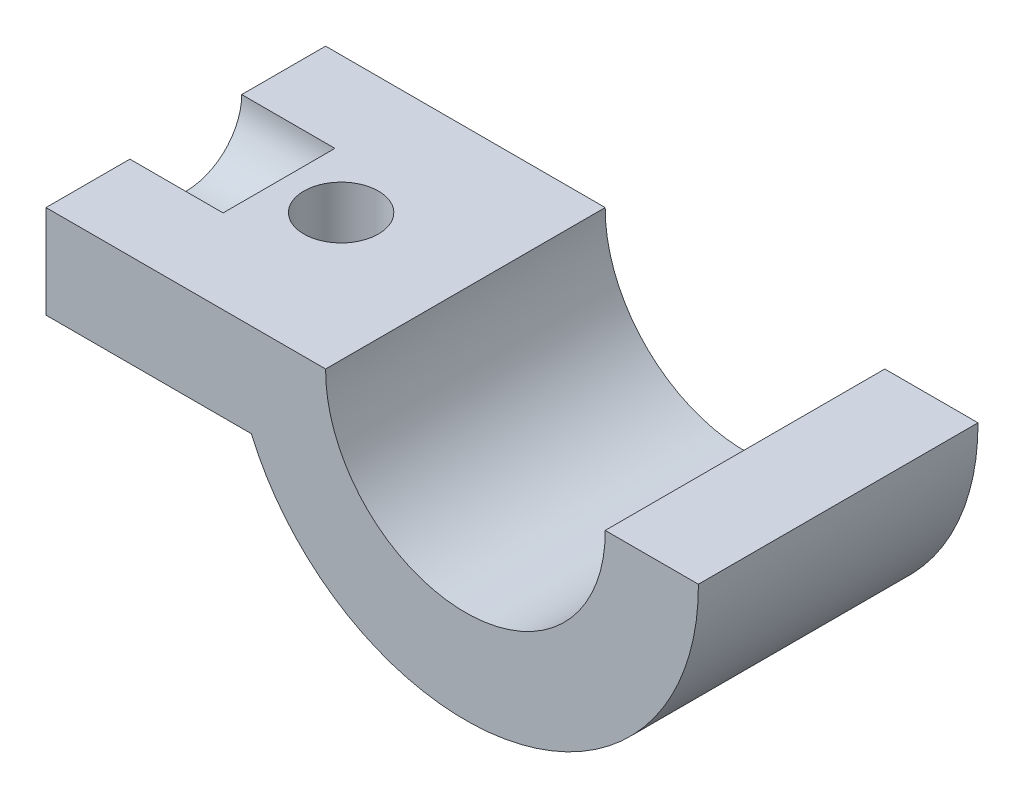
ISO-10303-21;
HEADER;
FILE_DESCRIPTION(('STEP AP214'),'2;1');
FILE_NAME('part.step','',(''),(''),'','','');
FILE_SCHEMA(('AUTOMOTIVE_DESIGN { 1 0 10303 214 1 1 1 1 }'));
ENDSEC;
DATA;
#1=APPLICATION_CONTEXT('core data for automotive mechanical design processes');
#2=APPLICATION_PROTOCOL_DEFINITION('international standard','automotive_design',2000,#1);
#3=PRODUCT_CONTEXT('',#1,'mechanical');
#4=PRODUCT('Part','Part','',(#3));
#5=PRODUCT_RELATED_PRODUCT_CATEGORY('part','',(#4));
#6=PRODUCT_DEFINITION_FORMATION('','',#4);
#7=PRODUCT_DEFINITION_CONTEXT('part definition',#1,'design');
#8=PRODUCT_DEFINITION('design','',#6,#7);
#9=PRODUCT_DEFINITION_SHAPE('','',#8);
#10=(LENGTH_UNIT() NAMED_UNIT(*) SI_UNIT(.MILLI.,.METRE.));
#11=(NAMED_UNIT(*) PLANE_ANGLE_UNIT() SI_UNIT($,.RADIAN.));
#12=(NAMED_UNIT(*) SI_UNIT($,.STERADIAN.) SOLID_ANGLE_UNIT());
#13=UNCERTAINTY_MEASURE_WITH_UNIT(LENGTH_MEASURE(1.E-05),#10,'distance_accuracy_value','');
#14=(GEOMETRIC_REPRESENTATION_CONTEXT(3) GLOBAL_UNCERTAINTY_ASSIGNED_CONTEXT((#13)) GLOBAL_UNIT_ASSIGNED_CONTEXT((#10,
#11,#12)) REPRESENTATION_CONTEXT('',''));
#15=CARTESIAN_POINT('',(0.,0.,0.));
#16=DIRECTION('',(0.,0.,1.));
#17=DIRECTION('',(1.,0.,0.));
#18=AXIS2_PLACEMENT_3D('',#15,#16,#17);
#19=CARTESIAN_POINT('',(9.58502536883147,-0.5,-1.5));
#20=DIRECTION('',(0.,-1.,0.));
#21=DIRECTION('',(1.,0.,0.));
#22=AXIS2_PLACEMENT_3D('',#19,#20,#21);
#23=PLANE('',#22);
#24=CARTESIAN_POINT('',(8.56480931815895,-0.500000000000053,-0.768458184701557));
#25=DIRECTION('',(0.,1.,0.));
#26=DIRECTION('',(-1.,0.,0.));
#27=AXIS2_PLACEMENT_3D('',#24,#25,#26);
#28=CIRCLE('',#27,0.200000000000001);
#29=CARTESIAN_POINT('',(8.36480931815895,-0.500000000000051,-0.768458184701557));
#30=VERTEX_POINT('',#29);
#31=EDGE_CURVE('E185',#30,#30,#28,.T.);
#32=ORIENTED_EDGE('',*,*,#31,.T.);
#33=EDGE_LOOP('',(#32));
#34=FACE_BOUND('',#33,.T.);
#35=DIRECTION('',(1.,0.,0.));
#36=VECTOR('',#35,1.);
#37=CARTESIAN_POINT('',(9.58502536883147,-0.5,0.));
#38=LINE('',#37,#36);
#39=CARTESIAN_POINT('',(7.74999999999999,-0.5,0.));
#40=VERTEX_POINT('',#39);
#41=CARTESIAN_POINT('',(8.85151010795144,-0.5,0.));
#42=VERTEX_POINT('',#41);
#43=EDGE_CURVE('E130',#40,#42,#38,.T.);
#44=ORIENTED_EDGE('',*,*,#43,.F.);
#45=DIRECTION('',(0.,0.,1.));
#46=VECTOR('',#45,1.);
#47=CARTESIAN_POINT('',(7.74999999999999,-0.5,-1.5));
#48=LINE('',#47,#46);
#49=CARTESIAN_POINT('',(7.74999999999999,-0.5,-1.5));
#50=VERTEX_POINT('',#49);
#51=EDGE_CURVE('E143',#50,#40,#48,.T.);
#52=ORIENTED_EDGE('',*,*,#51,.F.);
#53=DIRECTION('',(1.,0.,0.));
#54=VECTOR('',#53,1.);
#55=CARTESIAN_POINT('',(9.58502536883147,-0.5,-1.5));
#56=LINE('',#55,#54);
#57=CARTESIAN_POINT('',(8.85151010795144,-0.5,-1.5));
#58=VERTEX_POINT('',#57);
#59=EDGE_CURVE('E118',#50,#58,#56,.T.);
#60=ORIENTED_EDGE('',*,*,#59,.T.);
#61=DIRECTION('',(0.,0.,1.));
#62=VECTOR('',#61,1.);
#63=CARTESIAN_POINT('',(8.85151010795144,-0.5,-1.5));
#64=LINE('',#63,#62);
#65=EDGE_CURVE('E116',#58,#42,#64,.T.);
#66=ORIENTED_EDGE('',*,*,#65,.T.);
#67=EDGE_LOOP('',(#44,#52,#60,#66));
#68=FACE_BOUND('',#67,.T.);
#69=ADVANCED_FACE('F33',(#34,#68),#23,.T.);
#70=CARTESIAN_POINT('',(7.74999999999999,-3.58172628088967,-1.5));
#71=DIRECTION('',(-1.,0.,0.));
#72=DIRECTION('',(0.,0.,1.));
#73=AXIS2_PLACEMENT_3D('',#70,#71,#72);
#74=PLANE('',#73);
#75=CARTESIAN_POINT('',(7.74999999999999,0.,-0.75));
#76=DIRECTION('',(-1.,0.,0.));
#77=DIRECTION('',(0.,0.,1.));
#78=AXIS2_PLACEMENT_3D('',#75,#76,#77);
#79=CIRCLE('',#78,0.3);
#80=CARTESIAN_POINT('',(7.74999999999999,0.,-1.05));
#81=VERTEX_POINT('',#80);
#82=CARTESIAN_POINT('',(7.74999999999999,0.,-0.45));
#83=VERTEX_POINT('',#82);
#84=EDGE_CURVE('E157',#81,#83,#79,.T.);
#85=ORIENTED_EDGE('',*,*,#84,.F.);
#86=DIRECTION('',(0.,0.,1.));
#87=VECTOR('',#86,1.);
#88=CARTESIAN_POINT('',(7.74999999999999,0.,-1.5));
#89=LINE('',#88,#87);
#90=CARTESIAN_POINT('',(7.74999999999999,0.,-1.5));
#91=VERTEX_POINT('',#90);
#92=EDGE_CURVE('E146',#91,#81,#89,.T.);
#93=ORIENTED_EDGE('',*,*,#92,.F.);
#94=DIRECTION('',(0.,-1.,0.));
#95=VECTOR('',#94,1.);
#96=CARTESIAN_POINT('',(7.74999999999999,-3.58172628088967,-1.5));
#97=LINE('',#96,#95);
#98=EDGE_CURVE('E121',#91,#50,#97,.T.);
#99=ORIENTED_EDGE('',*,*,#98,.T.);
#100=ORIENTED_EDGE('',*,*,#51,.T.);
#101=DIRECTION('',(0.,-1.,0.));
#102=VECTOR('',#101,1.);
#103=CARTESIAN_POINT('',(7.74999999999999,-3.58172628088967,0.));
#104=LINE('',#103,#102);
#105=CARTESIAN_POINT('',(7.74999999999999,0.,0.));
#106=VERTEX_POINT('',#105);
#107=EDGE_CURVE('E138',#106,#40,#104,.T.);
#108=ORIENTED_EDGE('',*,*,#107,.F.);
#109=EDGE_CURVE('E149',#83,#106,#89,.T.);
#110=ORIENTED_EDGE('',*,*,#109,.F.);
#111=EDGE_LOOP('',(#85,#93,#99,#100,#108,#110));
#112=FACE_BOUND('',#111,.T.);
#113=ADVANCED_FACE('F175',(#112),#74,.T.);
#114=CARTESIAN_POINT('',(9.58502536883149,0.,-1.5));
#115=DIRECTION('',(0.,1.,0.));
#116=DIRECTION('',(-1.,0.,0.));
#117=AXIS2_PLACEMENT_3D('',#114,#115,#116);
#118=PLANE('',#117);
#119=CARTESIAN_POINT('',(8.56480931815895,0.,-0.768458184701557));
#120=DIRECTION('',(0.,1.,0.));
#121=DIRECTION('',(-1.,0.,0.));
#122=AXIS2_PLACEMENT_3D('',#119,#120,#121);
#123=CIRCLE('',#122,0.200000000000001);
#124=CARTESIAN_POINT('',(8.36480931815895,0.,-0.768458184701557));
#125=VERTEX_POINT('',#124);
#126=EDGE_CURVE('E193',#125,#125,#123,.T.);
#127=ORIENTED_EDGE('',*,*,#126,.F.);
#128=EDGE_LOOP('',(#127));
#129=FACE_BOUND('',#128,.T.);
#130=DIRECTION('',(0.,0.,1.));
#131=VECTOR('',#130,1.);
#132=CARTESIAN_POINT('',(9.25001631313702,0.,-1.5));
#133=LINE('',#132,#131);
#134=CARTESIAN_POINT('',(9.25001631313702,0.,-1.5));
#135=VERTEX_POINT('',#134);
#136=CARTESIAN_POINT('',(9.25001631313702,0.,0.));
#137=VERTEX_POINT('',#136);
#138=EDGE_CURVE('E103',#135,#137,#133,.T.);
#139=ORIENTED_EDGE('',*,*,#138,.F.);
#140=DIRECTION('',(-1.,0.,0.));
#141=VECTOR('',#140,1.);
#142=CARTESIAN_POINT('',(9.58502536883149,0.,-1.5));
#143=LINE('',#142,#141);
#144=EDGE_CURVE('E117',#135,#91,#143,.T.);
#145=ORIENTED_EDGE('',*,*,#144,.T.);
#146=ORIENTED_EDGE('',*,*,#92,.T.);
#147=DIRECTION('',(-1.,0.,0.));
#148=VECTOR('',#147,1.);
#149=CARTESIAN_POINT('',(8.24999999999999,0.,-1.05));
#150=LINE('',#149,#148);
#151=CARTESIAN_POINT('',(8.24999999999999,0.,-1.05));
#152=VERTEX_POINT('',#151);
#153=EDGE_CURVE('E11',#152,#81,#150,.T.);
#154=ORIENTED_EDGE('',*,*,#153,.F.);
#155=DIRECTION('',(0.,0.,1.));
#156=VECTOR('',#155,1.);
#157=CARTESIAN_POINT('',(8.24999999999999,0.,-1.5));
#158=LINE('',#157,#156);
#159=CARTESIAN_POINT('',(8.24999999999999,0.,-0.45));
#160=VERTEX_POINT('',#159);
#161=EDGE_CURVE('E145',#152,#160,#158,.T.);
#162=ORIENTED_EDGE('',*,*,#161,.T.);
#163=DIRECTION('',(-1.,0.,0.));
#164=VECTOR('',#163,1.);
#165=CARTESIAN_POINT('',(8.24999999999999,0.,-0.45));
#166=LINE('',#165,#164);
#167=EDGE_CURVE('E40',#83,#160,#166,.F.);
#168=ORIENTED_EDGE('',*,*,#167,.F.);
#169=ORIENTED_EDGE('',*,*,#109,.T.);
#170=DIRECTION('',(-1.,0.,0.));
#171=VECTOR('',#170,1.);
#172=CARTESIAN_POINT('',(9.58502536883149,0.,0.));
#173=LINE('',#172,#171);
#174=EDGE_CURVE('E135',#137,#106,#173,.T.);
#175=ORIENTED_EDGE('',*,*,#174,.F.);
#176=EDGE_LOOP('',(#139,#145,#146,#154,#162,#168,#169,#175));
#177=FACE_BOUND('',#176,.T.);
#178=ADVANCED_FACE('F161',(#129,#177),#118,.T.);
#179=CARTESIAN_POINT('',(9.99998776547986,-0.00654375051274973,-1.5));
#180=DIRECTION('',(0.,0.,1.));
#181=DIRECTION('',(1.,0.,0.));
#182=AXIS2_PLACEMENT_3D('',#179,#180,#181);
#183=CYLINDRICAL_SURFACE('',#182,1.25);
#184=DIRECTION('',(0.,0.,1.));
#185=VECTOR('',#184,1.);
#186=CARTESIAN_POINT('',(11.2499706370942,0.,-1.5));
#187=LINE('',#186,#185);
#188=CARTESIAN_POINT('',(11.2499706370942,0.,0.));
#189=VERTEX_POINT('',#188);
#190=CARTESIAN_POINT('',(11.2499706370942,0.,-1.5));
#191=VERTEX_POINT('',#190);
#192=EDGE_CURVE('E94',#189,#191,#187,.F.);
#193=ORIENTED_EDGE('',*,*,#192,.F.);
#194=CARTESIAN_POINT('',(9.99998776547986,-0.00654375051274973,0.));
#195=DIRECTION('',(0.,0.,1.));
#196=DIRECTION('',(1.,0.,0.));
#197=AXIS2_PLACEMENT_3D('',#194,#195,#196);
#198=CIRCLE('',#197,1.25);
#199=EDGE_CURVE('E133',#42,#189,#198,.T.);
#200=ORIENTED_EDGE('',*,*,#199,.F.);
#201=ORIENTED_EDGE('',*,*,#65,.F.);
#202=CARTESIAN_POINT('',(9.99998776547986,-0.00654375051274973,-1.5));
#203=DIRECTION('',(0.,0.,1.));
#204=DIRECTION('',(1.,0.,0.));
#205=AXIS2_PLACEMENT_3D('',#202,#203,#204);
#206=CIRCLE('',#205,1.25);
#207=EDGE_CURVE('E110',#58,#191,#206,.T.);
#208=ORIENTED_EDGE('',*,*,#207,.T.);
#209=EDGE_LOOP('',(#193,#200,#201,#208));
#210=FACE_BOUND('',#209,.T.);
#211=ADVANCED_FACE('F115',(#210),#183,.T.);
#212=CARTESIAN_POINT('',(9.99998776547986,-0.00654375051274973,-1.5));
#213=DIRECTION('',(0.,0.,1.));
#214=DIRECTION('',(1.,0.,0.));
#215=AXIS2_PLACEMENT_3D('',#212,#213,#214);
#216=CYLINDRICAL_SURFACE('',#215,0.75);
#217=CARTESIAN_POINT('',(9.99998776547986,-0.00654375051274973,0.));
#218=DIRECTION('',(0.,0.,1.));
#219=DIRECTION('',(1.,0.,0.));
#220=AXIS2_PLACEMENT_3D('',#217,#218,#219);
#221=CIRCLE('',#220,0.75);
#222=CARTESIAN_POINT('',(10.7499592178227,0.,0.));
#223=VERTEX_POINT('',#222);
#224=EDGE_CURVE('E123',#137,#223,#221,.T.);
#225=ORIENTED_EDGE('',*,*,#224,.T.);
#226=DIRECTION('',(0.,0.,1.));
#227=VECTOR('',#226,1.);
#228=CARTESIAN_POINT('',(10.7499592178227,0.,-1.5));
#229=LINE('',#228,#227);
#230=CARTESIAN_POINT('',(10.7499592178227,0.,-1.5));
#231=VERTEX_POINT('',#230);
#232=EDGE_CURVE('E47',#223,#231,#229,.F.);
#233=ORIENTED_EDGE('',*,*,#232,.T.);
#234=CARTESIAN_POINT('',(9.99998776547986,-0.00654375051274973,-1.5));
#235=DIRECTION('',(0.,0.,1.));
#236=DIRECTION('',(1.,0.,0.));
#237=AXIS2_PLACEMENT_3D('',#234,#235,#236);
#238=CIRCLE('',#237,0.75);
#239=EDGE_CURVE('E113',#135,#231,#238,.T.);
#240=ORIENTED_EDGE('',*,*,#239,.F.);
#241=ORIENTED_EDGE('',*,*,#138,.T.);
#242=EDGE_LOOP('',(#225,#233,#240,#241));
#243=FACE_BOUND('',#242,.T.);
#244=ADVANCED_FACE('F195',(#243),#216,.F.);
#245=CARTESIAN_POINT('',(9.58502536883147,-3.58172628088967,-1.5));
#246=DIRECTION('',(0.,0.,1.));
#247=DIRECTION('',(1.,0.,0.));
#248=AXIS2_PLACEMENT_3D('',#245,#246,#247);
#249=PLANE('',#248);
#250=ORIENTED_EDGE('',*,*,#144,.F.);
#251=ORIENTED_EDGE('',*,*,#239,.T.);
#252=DIRECTION('',(-1.,0.,0.));
#253=VECTOR('',#252,1.);
#254=CARTESIAN_POINT('',(8.75000489386553,0.,-1.5));
#255=LINE('',#254,#253);
#256=EDGE_CURVE('E97',#191,#231,#255,.T.);
#257=ORIENTED_EDGE('',*,*,#256,.F.);
#258=ORIENTED_EDGE('',*,*,#207,.F.);
#259=ORIENTED_EDGE('',*,*,#59,.F.);
#260=ORIENTED_EDGE('',*,*,#98,.F.);
#261=EDGE_LOOP('',(#250,#251,#257,#258,#259,#260));
#262=FACE_BOUND('',#261,.T.);
#263=ADVANCED_FACE('F108',(#262),#249,.F.);
#264=CARTESIAN_POINT('',(9.58502536883147,-3.58172628088967,0.));
#265=DIRECTION('',(0.,0.,1.));
#266=DIRECTION('',(1.,0.,0.));
#267=AXIS2_PLACEMENT_3D('',#264,#265,#266);
#268=PLANE('',#267);
#269=ORIENTED_EDGE('',*,*,#224,.F.);
#270=ORIENTED_EDGE('',*,*,#174,.T.);
#271=ORIENTED_EDGE('',*,*,#107,.T.);
#272=ORIENTED_EDGE('',*,*,#43,.T.);
#273=ORIENTED_EDGE('',*,*,#199,.T.);
#274=DIRECTION('',(1.,0.,0.));
#275=VECTOR('',#274,1.);
#276=CARTESIAN_POINT('',(9.58502536883147,0.,0.));
#277=LINE('',#276,#275);
#278=EDGE_CURVE('E98',#223,#189,#277,.T.);
#279=ORIENTED_EDGE('',*,*,#278,.F.);
#280=EDGE_LOOP('',(#269,#270,#271,#272,#273,#279));
#281=FACE_BOUND('',#280,.T.);
#282=ADVANCED_FACE('F172',(#281),#268,.T.);
#283=CARTESIAN_POINT('',(8.24999999999999,0.,-0.75));
#284=DIRECTION('',(-1.,0.,0.));
#285=DIRECTION('',(0.,0.,1.));
#286=AXIS2_PLACEMENT_3D('',#283,#284,#285);
#287=CYLINDRICAL_SURFACE('',#286,0.3);
#288=ORIENTED_EDGE('',*,*,#153,.T.);
#289=ORIENTED_EDGE('',*,*,#84,.T.);
#290=ORIENTED_EDGE('',*,*,#167,.T.);
#291=CARTESIAN_POINT('',(8.24999999999999,0.,-0.75));
#292=DIRECTION('',(-1.,0.,0.));
#293=DIRECTION('',(0.,0.,1.));
#294=AXIS2_PLACEMENT_3D('',#291,#292,#293);
#295=CIRCLE('',#294,0.3);
#296=EDGE_CURVE('E54',#152,#160,#295,.T.);
#297=ORIENTED_EDGE('',*,*,#296,.F.);
#298=EDGE_LOOP('',(#288,#289,#290,#297));
#299=FACE_BOUND('',#298,.T.);
#300=ADVANCED_FACE('F154',(#299),#287,.F.);
#301=CARTESIAN_POINT('',(8.24999999999999,0.,-0.75));
#302=DIRECTION('',(-1.,0.,0.));
#303=DIRECTION('',(0.,0.,1.));
#304=AXIS2_PLACEMENT_3D('',#301,#302,#303);
#305=PLANE('',#304);
#306=ORIENTED_EDGE('',*,*,#296,.T.);
#307=ORIENTED_EDGE('',*,*,#161,.F.);
#308=EDGE_LOOP('',(#306,#307));
#309=FACE_BOUND('',#308,.T.);
#310=ADVANCED_FACE('F162',(#309),#305,.T.);
#311=CARTESIAN_POINT('',(8.56480931815895,-0.500000000000053,-0.768458184701557));
#312=DIRECTION('',(0.,1.,0.));
#313=DIRECTION('',(-1.,0.,0.));
#314=AXIS2_PLACEMENT_3D('',#311,#312,#313);
#315=CYLINDRICAL_SURFACE('',#314,0.200000000000001);
#316=ORIENTED_EDGE('',*,*,#31,.F.);
#317=EDGE_LOOP('',(#316));
#318=FACE_BOUND('',#317,.T.);
#319=ORIENTED_EDGE('',*,*,#126,.T.);
#320=EDGE_LOOP('',(#319));
#321=FACE_BOUND('',#320,.T.);
#322=ADVANCED_FACE('F164',(#318,#321),#315,.F.);
#323=CARTESIAN_POINT('',(8.75000489386553,0.,1.62));
#324=DIRECTION('',(0.,-1.,0.));
#325=DIRECTION('',(0.,0.,-1.));
#326=AXIS2_PLACEMENT_3D('',#323,#324,#325);
#327=PLANE('',#326);
#328=ORIENTED_EDGE('',*,*,#192,.T.);
#329=ORIENTED_EDGE('',*,*,#256,.T.);
#330=ORIENTED_EDGE('',*,*,#232,.F.);
#331=ORIENTED_EDGE('',*,*,#278,.T.);
#332=EDGE_LOOP('',(#328,#329,#330,#331));
#333=FACE_BOUND('',#332,.T.);
#334=ADVANCED_FACE('F96',(#333),#327,.F.);
#335=CLOSED_SHELL('',(#69,#113,#178,#211,#244,#263,#282,#300,#310,#322,#334));
#336=MANIFOLD_SOLID_BREP('B2',#335);
#337=ADVANCED_BREP_SHAPE_REPRESENTATION('',(#18,#336),#14);
#338=SHAPE_DEFINITION_REPRESENTATION(#9,#337);
ENDSEC;
END-ISO-10303-21;
